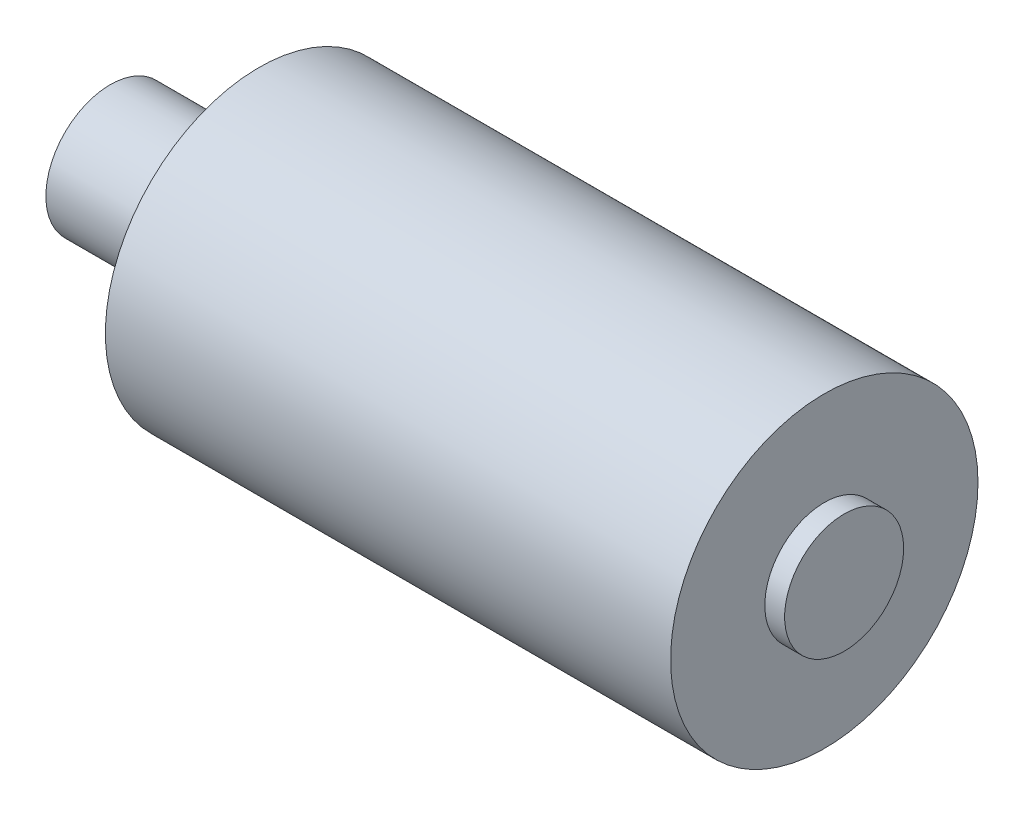
ISO-10303-21;
HEADER;
FILE_DESCRIPTION(('STEP AP214'),'2;1');
FILE_NAME('part.step','',(''),(''),'','','');
FILE_SCHEMA(('AUTOMOTIVE_DESIGN { 1 0 10303 214 1 1 1 1 }'));
ENDSEC;
DATA;
#1=APPLICATION_CONTEXT('core data for automotive mechanical design processes');
#2=APPLICATION_PROTOCOL_DEFINITION('international standard','automotive_design',2000,#1);
#3=PRODUCT_CONTEXT('',#1,'mechanical');
#4=PRODUCT('Part','Part','',(#3));
#5=PRODUCT_RELATED_PRODUCT_CATEGORY('part','',(#4));
#6=PRODUCT_DEFINITION_FORMATION('','',#4);
#7=PRODUCT_DEFINITION_CONTEXT('part definition',#1,'design');
#8=PRODUCT_DEFINITION('design','',#6,#7);
#9=PRODUCT_DEFINITION_SHAPE('','',#8);
#10=(LENGTH_UNIT() NAMED_UNIT(*) SI_UNIT(.MILLI.,.METRE.));
#11=(NAMED_UNIT(*) PLANE_ANGLE_UNIT() SI_UNIT($,.RADIAN.));
#12=(NAMED_UNIT(*) SI_UNIT($,.STERADIAN.) SOLID_ANGLE_UNIT());
#13=UNCERTAINTY_MEASURE_WITH_UNIT(LENGTH_MEASURE(1.E-05),#10,'distance_accuracy_value','');
#14=(GEOMETRIC_REPRESENTATION_CONTEXT(3) GLOBAL_UNCERTAINTY_ASSIGNED_CONTEXT((#13)) GLOBAL_UNIT_ASSIGNED_CONTEXT((#10,
#11,#12)) REPRESENTATION_CONTEXT('',''));
#15=CARTESIAN_POINT('',(0.,0.,0.));
#16=DIRECTION('',(0.,0.,1.));
#17=DIRECTION('',(1.,0.,0.));
#18=AXIS2_PLACEMENT_3D('',#15,#16,#17);
#19=CARTESIAN_POINT('',(57.,0.,0.));
#20=DIRECTION('',(-1.,0.,0.));
#21=DIRECTION('',(0.,0.,1.));
#22=AXIS2_PLACEMENT_3D('',#19,#20,#21);
#23=CYLINDRICAL_SURFACE('',#22,15.5);
#24=CARTESIAN_POINT('',(57.,0.,0.));
#25=DIRECTION('',(1.,0.,0.));
#26=DIRECTION('',(0.,0.,-1.));
#27=AXIS2_PLACEMENT_3D('',#24,#25,#26);
#28=CIRCLE('',#27,15.5);
#29=CARTESIAN_POINT('',(57.,0.,-15.5));
#30=VERTEX_POINT('',#29);
#31=EDGE_CURVE('E39',#30,#30,#28,.T.);
#32=ORIENTED_EDGE('',*,*,#31,.F.);
#33=EDGE_LOOP('',(#32));
#34=FACE_BOUND('',#33,.T.);
#35=CARTESIAN_POINT('',(0.,0.,0.));
#36=DIRECTION('',(1.,0.,0.));
#37=DIRECTION('',(0.,0.,-1.));
#38=AXIS2_PLACEMENT_3D('',#35,#36,#37);
#39=CIRCLE('',#38,15.5);
#40=CARTESIAN_POINT('',(0.,0.,-15.5));
#41=VERTEX_POINT('',#40);
#42=EDGE_CURVE('E35',#41,#41,#39,.T.);
#43=ORIENTED_EDGE('',*,*,#42,.T.);
#44=EDGE_LOOP('',(#43));
#45=FACE_BOUND('',#44,.T.);
#46=ADVANCED_FACE('F32',(#34,#45),#23,.T.);
#47=CARTESIAN_POINT('',(57.,0.,0.));
#48=DIRECTION('',(1.,0.,0.));
#49=DIRECTION('',(0.,0.,-1.));
#50=AXIS2_PLACEMENT_3D('',#47,#48,#49);
#51=PLANE('',#50);
#52=CARTESIAN_POINT('',(57.,0.,0.));
#53=DIRECTION('',(1.,0.,0.));
#54=DIRECTION('',(0.,0.,-1.));
#55=AXIS2_PLACEMENT_3D('',#52,#53,#54);
#56=CIRCLE('',#55,6.);
#57=CARTESIAN_POINT('',(57.,0.,-6.));
#58=VERTEX_POINT('',#57);
#59=EDGE_CURVE('E10',#58,#58,#56,.T.);
#60=ORIENTED_EDGE('',*,*,#59,.F.);
#61=EDGE_LOOP('',(#60));
#62=FACE_BOUND('',#61,.T.);
#63=ORIENTED_EDGE('',*,*,#31,.T.);
#64=EDGE_LOOP('',(#63));
#65=FACE_BOUND('',#64,.T.);
#66=ADVANCED_FACE('F72',(#62,#65),#51,.T.);
#67=CARTESIAN_POINT('',(0.,0.,0.));
#68=DIRECTION('',(1.,0.,0.));
#69=DIRECTION('',(0.,0.,-1.));
#70=AXIS2_PLACEMENT_3D('',#67,#68,#69);
#71=PLANE('',#70);
#72=CARTESIAN_POINT('',(0.,0.,0.));
#73=DIRECTION('',(1.,0.,0.));
#74=DIRECTION('',(0.,0.,-1.));
#75=AXIS2_PLACEMENT_3D('',#72,#73,#74);
#76=CIRCLE('',#75,6.5);
#77=CARTESIAN_POINT('',(0.,0.,-6.5));
#78=VERTEX_POINT('',#77);
#79=EDGE_CURVE('E50',#78,#78,#76,.T.);
#80=ORIENTED_EDGE('',*,*,#79,.T.);
#81=EDGE_LOOP('',(#80));
#82=FACE_BOUND('',#81,.T.);
#83=ORIENTED_EDGE('',*,*,#42,.F.);
#84=EDGE_LOOP('',(#83));
#85=FACE_BOUND('',#84,.T.);
#86=ADVANCED_FACE('F77',(#82,#85),#71,.F.);
#87=CARTESIAN_POINT('',(-15.,0.,0.));
#88=DIRECTION('',(1.,0.,0.));
#89=DIRECTION('',(0.,0.,-1.));
#90=AXIS2_PLACEMENT_3D('',#87,#88,#89);
#91=CYLINDRICAL_SURFACE('',#90,6.5);
#92=CARTESIAN_POINT('',(-15.,0.,0.));
#93=DIRECTION('',(1.,0.,0.));
#94=DIRECTION('',(0.,0.,-1.));
#95=AXIS2_PLACEMENT_3D('',#92,#93,#94);
#96=CIRCLE('',#95,6.5);
#97=CARTESIAN_POINT('',(-15.,0.,-6.5));
#98=VERTEX_POINT('',#97);
#99=EDGE_CURVE('E47',#98,#98,#96,.T.);
#100=ORIENTED_EDGE('',*,*,#99,.T.);
#101=EDGE_LOOP('',(#100));
#102=FACE_BOUND('',#101,.T.);
#103=ORIENTED_EDGE('',*,*,#79,.F.);
#104=EDGE_LOOP('',(#103));
#105=FACE_BOUND('',#104,.T.);
#106=ADVANCED_FACE('F68',(#102,#105),#91,.T.);
#107=CARTESIAN_POINT('',(-15.,0.,0.));
#108=DIRECTION('',(1.,0.,0.));
#109=DIRECTION('',(0.,0.,-1.));
#110=AXIS2_PLACEMENT_3D('',#107,#108,#109);
#111=PLANE('',#110);
#112=ORIENTED_EDGE('',*,*,#99,.F.);
#113=EDGE_LOOP('',(#112));
#114=FACE_BOUND('',#113,.T.);
#115=ADVANCED_FACE('F61',(#114),#111,.F.);
#116=CARTESIAN_POINT('',(59.,0.,0.));
#117=DIRECTION('',(-1.,0.,0.));
#118=DIRECTION('',(0.,0.,1.));
#119=AXIS2_PLACEMENT_3D('',#116,#117,#118);
#120=CYLINDRICAL_SURFACE('',#119,6.);
#121=CARTESIAN_POINT('',(59.,0.,0.));
#122=DIRECTION('',(1.,0.,0.));
#123=DIRECTION('',(0.,0.,-1.));
#124=AXIS2_PLACEMENT_3D('',#121,#122,#123);
#125=CIRCLE('',#124,6.);
#126=CARTESIAN_POINT('',(59.,0.,-6.));
#127=VERTEX_POINT('',#126);
#128=EDGE_CURVE('E46',#127,#127,#125,.T.);
#129=ORIENTED_EDGE('',*,*,#128,.F.);
#130=EDGE_LOOP('',(#129));
#131=FACE_BOUND('',#130,.T.);
#132=ORIENTED_EDGE('',*,*,#59,.T.);
#133=EDGE_LOOP('',(#132));
#134=FACE_BOUND('',#133,.T.);
#135=ADVANCED_FACE('F59',(#131,#134),#120,.T.);
#136=CARTESIAN_POINT('',(59.,0.,0.));
#137=DIRECTION('',(1.,0.,0.));
#138=DIRECTION('',(0.,0.,-1.));
#139=AXIS2_PLACEMENT_3D('',#136,#137,#138);
#140=PLANE('',#139);
#141=ORIENTED_EDGE('',*,*,#128,.T.);
#142=EDGE_LOOP('',(#141));
#143=FACE_BOUND('',#142,.T.);
#144=ADVANCED_FACE('F57',(#143),#140,.T.);
#145=CLOSED_SHELL('',(#46,#66,#86,#106,#115,#135,#144));
#146=MANIFOLD_SOLID_BREP('B2',#145);
#147=ADVANCED_BREP_SHAPE_REPRESENTATION('',(#18,#146),#14);
#148=SHAPE_DEFINITION_REPRESENTATION(#9,#147);
ENDSEC;
END-ISO-10303-21;
